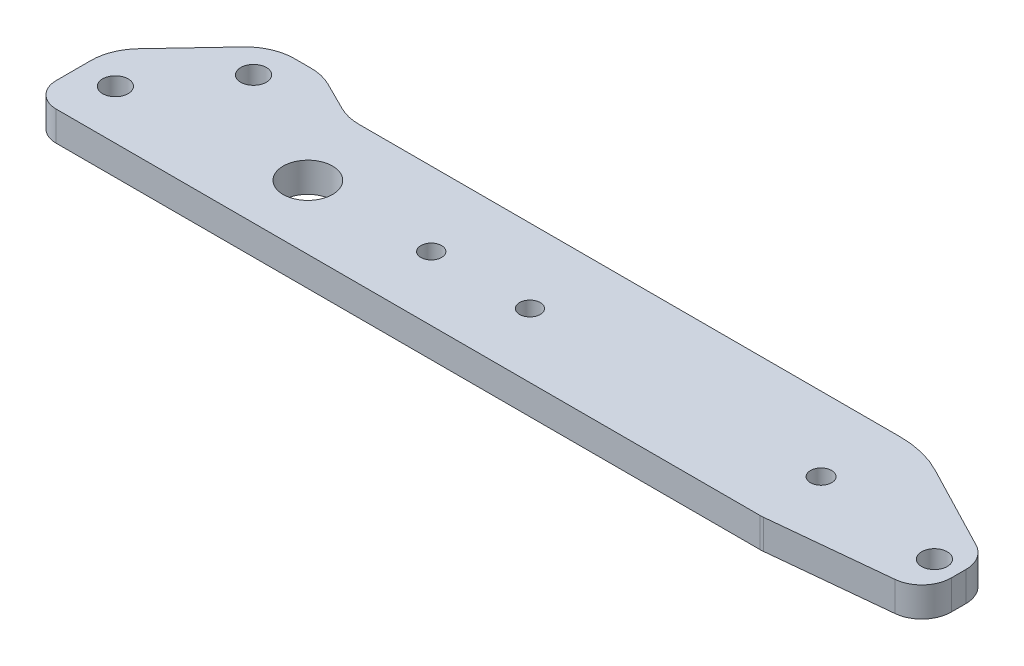
ISO-10303-21;
HEADER;
FILE_DESCRIPTION(('STEP AP214'),'2;1');
FILE_NAME('part.step','',(''),(''),'','','');
FILE_SCHEMA(('AUTOMOTIVE_DESIGN { 1 0 10303 214 1 1 1 1 }'));
ENDSEC;
DATA;
#1=APPLICATION_CONTEXT('core data for automotive mechanical design processes');
#2=APPLICATION_PROTOCOL_DEFINITION('international standard','automotive_design',2000,#1);
#3=PRODUCT_CONTEXT('',#1,'mechanical');
#4=PRODUCT('Part','Part','',(#3));
#5=PRODUCT_RELATED_PRODUCT_CATEGORY('part','',(#4));
#6=PRODUCT_DEFINITION_FORMATION('','',#4);
#7=PRODUCT_DEFINITION_CONTEXT('part definition',#1,'design');
#8=PRODUCT_DEFINITION('design','',#6,#7);
#9=PRODUCT_DEFINITION_SHAPE('','',#8);
#10=(LENGTH_UNIT() NAMED_UNIT(*) SI_UNIT(.MILLI.,.METRE.));
#11=(NAMED_UNIT(*) PLANE_ANGLE_UNIT() SI_UNIT($,.RADIAN.));
#12=(NAMED_UNIT(*) SI_UNIT($,.STERADIAN.) SOLID_ANGLE_UNIT());
#13=UNCERTAINTY_MEASURE_WITH_UNIT(LENGTH_MEASURE(1.E-05),#10,'distance_accuracy_value','');
#14=(GEOMETRIC_REPRESENTATION_CONTEXT(3) GLOBAL_UNCERTAINTY_ASSIGNED_CONTEXT((#13)) GLOBAL_UNIT_ASSIGNED_CONTEXT((#10,
#11,#12)) REPRESENTATION_CONTEXT('',''));
#15=CARTESIAN_POINT('',(0.,0.,0.));
#16=DIRECTION('',(0.,0.,1.));
#17=DIRECTION('',(1.,0.,0.));
#18=AXIS2_PLACEMENT_3D('',#15,#16,#17);
#19=CARTESIAN_POINT('',(0.,6.,0.));
#20=DIRECTION('',(0.,1.,0.));
#21=DIRECTION('',(0.,0.,1.));
#22=AXIS2_PLACEMENT_3D('',#19,#20,#21);
#23=PLANE('',#22);
#24=CARTESIAN_POINT('',(50.,6.,-13.));
#25=DIRECTION('',(0.,1.,0.));
#26=DIRECTION('',(0.,0.,1.));
#27=AXIS2_PLACEMENT_3D('',#24,#25,#26);
#28=CIRCLE('',#27,2.1);
#29=CARTESIAN_POINT('',(50.,6.,-10.9));
#30=VERTEX_POINT('',#29);
#31=EDGE_CURVE('E378',#30,#30,#28,.T.);
#32=ORIENTED_EDGE('',*,*,#31,.F.);
#33=EDGE_LOOP('',(#32));
#34=FACE_BOUND('',#33,.T.);
#35=CARTESIAN_POINT('',(25.,6.,-13.));
#36=DIRECTION('',(0.,1.,0.));
#37=DIRECTION('',(0.,0.,1.));
#38=AXIS2_PLACEMENT_3D('',#35,#36,#37);
#39=CIRCLE('',#38,5.);
#40=CARTESIAN_POINT('',(25.,6.,-8.));
#41=VERTEX_POINT('',#40);
#42=EDGE_CURVE('E366',#41,#41,#39,.T.);
#43=ORIENTED_EDGE('',*,*,#42,.F.);
#44=EDGE_LOOP('',(#43));
#45=FACE_BOUND('',#44,.T.);
#46=CARTESIAN_POINT('',(-11.,6.,-10.));
#47=DIRECTION('',(0.,1.,0.));
#48=DIRECTION('',(0.,0.,1.));
#49=AXIS2_PLACEMENT_3D('',#46,#47,#48);
#50=CIRCLE('',#49,2.6);
#51=CARTESIAN_POINT('',(-11.,6.,-7.4));
#52=VERTEX_POINT('',#51);
#53=EDGE_CURVE('E354',#52,#52,#50,.T.);
#54=ORIENTED_EDGE('',*,*,#53,.F.);
#55=EDGE_LOOP('',(#54));
#56=FACE_BOUND('',#55,.T.);
#57=DIRECTION('',(-0.894427190999916,0.,-0.447213595499958));
#58=VECTOR('',#57,1.);
#59=CARTESIAN_POINT('',(8.,6.,-33.));
#60=LINE('',#59,#58);
#61=CARTESIAN_POINT('',(15.8885438199983,6.,-29.0557280900008));
#62=VERTEX_POINT('',#61);
#63=CARTESIAN_POINT('',(10.1114561800017,6.,-31.9442719099992));
#64=VERTEX_POINT('',#63);
#65=EDGE_CURVE('E286',#62,#64,#60,.T.);
#66=ORIENTED_EDGE('',*,*,#65,.T.);
#67=CARTESIAN_POINT('',(5.63932022500211,6.,-23.));
#68=DIRECTION('',(0.,1.,0.));
#69=DIRECTION('',(0.,0.,1.));
#70=AXIS2_PLACEMENT_3D('',#67,#68,#69);
#71=CIRCLE('',#70,10.);
#72=CARTESIAN_POINT('',(5.63932022500211,6.,-33.));
#73=VERTEX_POINT('',#72);
#74=EDGE_CURVE('E52',#64,#73,#71,.T.);
#75=ORIENTED_EDGE('',*,*,#74,.T.);
#76=DIRECTION('',(-1.,0.,0.));
#77=VECTOR('',#76,1.);
#78=CARTESIAN_POINT('',(-2.,6.,-33.));
#79=LINE('',#78,#77);
#80=CARTESIAN_POINT('',(2.32072650579853,6.,-33.));
#81=VERTEX_POINT('',#80);
#82=EDGE_CURVE('E290',#73,#81,#79,.T.);
#83=ORIENTED_EDGE('',*,*,#82,.T.);
#84=CARTESIAN_POINT('',(2.32072650579853,6.,-23.));
#85=DIRECTION('',(0.,1.,0.));
#86=DIRECTION('',(0.,0.,1.));
#87=AXIS2_PLACEMENT_3D('',#84,#85,#86);
#88=CIRCLE('',#87,10.);
#89=CARTESIAN_POINT('',(-4.96127342112951,6.,-29.8536469900499));
#90=VERTEX_POINT('',#89);
#91=EDGE_CURVE('E242',#81,#90,#88,.T.);
#92=ORIENTED_EDGE('',*,*,#91,.T.);
#93=DIRECTION('',(-0.685364699004991,0.,0.728199992692803));
#94=VECTOR('',#93,1.);
#95=CARTESIAN_POINT('',(-18.,6.,-16.));
#96=LINE('',#95,#94);
#97=CARTESIAN_POINT('',(-15.281999926928,6.,-18.887875077639));
#98=VERTEX_POINT('',#97);
#99=EDGE_CURVE('E292',#90,#98,#96,.T.);
#100=ORIENTED_EDGE('',*,*,#99,.T.);
#101=CARTESIAN_POINT('',(-8.,6.,-12.0342280875891));
#102=DIRECTION('',(0.,1.,0.));
#103=DIRECTION('',(0.,0.,1.));
#104=AXIS2_PLACEMENT_3D('',#101,#102,#103);
#105=CIRCLE('',#104,10.);
#106=CARTESIAN_POINT('',(-18.,6.,-12.0342280875891));
#107=VERTEX_POINT('',#106);
#108=EDGE_CURVE('E240',#98,#107,#105,.T.);
#109=ORIENTED_EDGE('',*,*,#108,.T.);
#110=DIRECTION('',(0.,0.,1.));
#111=VECTOR('',#110,1.);
#112=CARTESIAN_POINT('',(-18.,6.,-16.));
#113=LINE('',#112,#111);
#114=CARTESIAN_POINT('',(-18.,6.,-5.));
#115=VERTEX_POINT('',#114);
#116=EDGE_CURVE('E183',#107,#115,#113,.T.);
#117=ORIENTED_EDGE('',*,*,#116,.T.);
#118=CARTESIAN_POINT('',(-13.,6.,-5.));
#119=DIRECTION('',(0.,1.,0.));
#120=DIRECTION('',(0.,0.,1.));
#121=AXIS2_PLACEMENT_3D('',#118,#119,#120);
#122=CIRCLE('',#121,5.);
#123=CARTESIAN_POINT('',(-13.,6.,0.));
#124=VERTEX_POINT('',#123);
#125=EDGE_CURVE('E199',#115,#124,#122,.T.);
#126=ORIENTED_EDGE('',*,*,#125,.T.);
#127=DIRECTION('',(1.,0.,0.));
#128=VECTOR('',#127,1.);
#129=CARTESIAN_POINT('',(0.,6.,0.));
#130=LINE('',#129,#128);
#131=CARTESIAN_POINT('',(129.666126278875,6.,0.));
#132=VERTEX_POINT('',#131);
#133=EDGE_CURVE('E182',#124,#132,#130,.T.);
#134=ORIENTED_EDGE('',*,*,#133,.T.);
#135=CARTESIAN_POINT('',(129.666126278875,6.,-6.));
#136=DIRECTION('',(0.,1.,0.));
#137=DIRECTION('',(0.,0.,1.));
#138=AXIS2_PLACEMENT_3D('',#135,#136,#137);
#139=CIRCLE('',#138,6.);
#140=CARTESIAN_POINT('',(130.263148593001,6.,-0.0297768587400656));
#141=VERTEX_POINT('',#140);
#142=EDGE_CURVE('E217',#132,#141,#139,.T.);
#143=ORIENTED_EDGE('',*,*,#142,.T.);
#144=DIRECTION('',(0.995037190209989,0.,-0.0995037190209989));
#145=VECTOR('',#144,1.);
#146=CARTESIAN_POINT('',(159.9653800056,6.,-3.));
#147=LINE('',#146,#145);
#148=CARTESIAN_POINT('',(154.562402319726,6.,-2.4597022314126));
#149=VERTEX_POINT('',#148);
#150=EDGE_CURVE('E192',#141,#149,#147,.T.);
#151=ORIENTED_EDGE('',*,*,#150,.T.);
#152=CARTESIAN_POINT('',(153.9653800056,6.,-8.42992537267254));
#153=DIRECTION('',(0.,1.,0.));
#154=DIRECTION('',(0.,0.,1.));
#155=AXIS2_PLACEMENT_3D('',#152,#153,#154);
#156=CIRCLE('',#155,6.);
#157=CARTESIAN_POINT('',(159.9653800056,6.,-8.42992537267254));
#158=VERTEX_POINT('',#157);
#159=EDGE_CURVE('E215',#149,#158,#156,.T.);
#160=ORIENTED_EDGE('',*,*,#159,.T.);
#161=DIRECTION('',(0.,0.,-1.));
#162=VECTOR('',#161,1.);
#163=CARTESIAN_POINT('',(159.9653800056,6.,-3.));
#164=LINE('',#163,#162);
#165=CARTESIAN_POINT('',(159.9653800056,6.,-11.3572786542694));
#166=VERTEX_POINT('',#165);
#167=EDGE_CURVE('E345',#158,#166,#164,.T.);
#168=ORIENTED_EDGE('',*,*,#167,.T.);
#169=CARTESIAN_POINT('',(153.9653800056,6.,-11.3572786542694));
#170=DIRECTION('',(0.,1.,0.));
#171=DIRECTION('',(0.,0.,1.));
#172=AXIS2_PLACEMENT_3D('',#169,#170,#171);
#173=CIRCLE('',#172,6.);
#174=CARTESIAN_POINT('',(156.733496425452,6.,-16.680579461677));
#175=VERTEX_POINT('',#174);
#176=EDGE_CURVE('E213',#166,#175,#173,.T.);
#177=ORIENTED_EDGE('',*,*,#176,.T.);
#178=DIRECTION('',(-0.887216801234595,0.,-0.46135273664199));
#179=VECTOR('',#178,1.);
#180=CARTESIAN_POINT('',(159.9653800056,6.,-15.));
#181=LINE('',#180,#179);
#182=CARTESIAN_POINT('',(139.303195342731,6.,-25.7443360246919));
#183=VERTEX_POINT('',#182);
#184=EDGE_CURVE('E294',#175,#183,#181,.T.);
#185=ORIENTED_EDGE('',*,*,#184,.T.);
#186=CARTESIAN_POINT('',(130.076140609891,6.,-8.));
#187=DIRECTION('',(0.,1.,0.));
#188=DIRECTION('',(0.,0.,1.));
#189=AXIS2_PLACEMENT_3D('',#186,#187,#188);
#190=CIRCLE('',#189,20.);
#191=CARTESIAN_POINT('',(130.076140609891,6.,-28.));
#192=VERTEX_POINT('',#191);
#193=EDGE_CURVE('E254',#183,#192,#190,.T.);
#194=ORIENTED_EDGE('',*,*,#193,.T.);
#195=DIRECTION('',(-1.,0.,0.));
#196=VECTOR('',#195,1.);
#197=CARTESIAN_POINT('',(18.,6.,-28.));
#198=LINE('',#197,#196);
#199=CARTESIAN_POINT('',(20.3606797749979,6.,-28.));
#200=VERTEX_POINT('',#199);
#201=EDGE_CURVE('E287',#192,#200,#198,.T.);
#202=ORIENTED_EDGE('',*,*,#201,.T.);
#203=CARTESIAN_POINT('',(20.3606797749979,6.,-38.));
#204=DIRECTION('',(0.,1.,0.));
#205=DIRECTION('',(0.,0.,1.));
#206=AXIS2_PLACEMENT_3D('',#203,#204,#205);
#207=CIRCLE('',#206,10.);
#208=EDGE_CURVE('E11',#200,#62,#207,.F.);
#209=ORIENTED_EDGE('',*,*,#208,.T.);
#210=EDGE_LOOP('',(#66,#75,#83,#92,#100,#109,#117,#126,#134,#143,#151,#160,#168,#177,#185,#194,
#202,#209));
#211=FACE_BOUND('',#210,.T.);
#212=CARTESIAN_POINT('',(154.9653800056,6.,-10.));
#213=DIRECTION('',(0.,1.,0.));
#214=DIRECTION('',(0.,0.,1.));
#215=AXIS2_PLACEMENT_3D('',#212,#213,#214);
#216=CIRCLE('',#215,2.59999999999999);
#217=CARTESIAN_POINT('',(154.9653800056,6.,-7.40000000000001));
#218=VERTEX_POINT('',#217);
#219=EDGE_CURVE('E305',#218,#218,#216,.T.);
#220=ORIENTED_EDGE('',*,*,#219,.F.);
#221=EDGE_LOOP('',(#220));
#222=FACE_BOUND('',#221,.T.);
#223=CARTESIAN_POINT('',(129.,6.,-13.));
#224=DIRECTION('',(0.,1.,0.));
#225=DIRECTION('',(0.,0.,1.));
#226=AXIS2_PLACEMENT_3D('',#223,#224,#225);
#227=CIRCLE('',#226,2.15000000000002);
#228=CARTESIAN_POINT('',(129.,6.,-10.85));
#229=VERTEX_POINT('',#228);
#230=EDGE_CURVE('E360',#229,#229,#227,.T.);
#231=ORIENTED_EDGE('',*,*,#230,.F.);
#232=EDGE_LOOP('',(#231));
#233=FACE_BOUND('',#232,.T.);
#234=CARTESIAN_POINT('',(0.999999999999992,6.,-26.));
#235=DIRECTION('',(0.,1.,0.));
#236=DIRECTION('',(0.,0.,1.));
#237=AXIS2_PLACEMENT_3D('',#234,#235,#236);
#238=CIRCLE('',#237,2.6);
#239=CARTESIAN_POINT('',(0.999999999999992,6.,-23.4));
#240=VERTEX_POINT('',#239);
#241=EDGE_CURVE('E372',#240,#240,#238,.T.);
#242=ORIENTED_EDGE('',*,*,#241,.F.);
#243=EDGE_LOOP('',(#242));
#244=FACE_BOUND('',#243,.T.);
#245=CARTESIAN_POINT('',(70.,6.,-13.));
#246=DIRECTION('',(0.,1.,0.));
#247=DIRECTION('',(0.,0.,1.));
#248=AXIS2_PLACEMENT_3D('',#245,#246,#247);
#249=CIRCLE('',#248,2.1);
#250=CARTESIAN_POINT('',(70.,6.,-10.9));
#251=VERTEX_POINT('',#250);
#252=EDGE_CURVE('E384',#251,#251,#249,.T.);
#253=ORIENTED_EDGE('',*,*,#252,.F.);
#254=EDGE_LOOP('',(#253));
#255=FACE_BOUND('',#254,.T.);
#256=ADVANCED_FACE('F37',(#34,#45,#56,#211,#222,#233,#244,#255),#23,.T.);
#257=CARTESIAN_POINT('',(0.,0.,0.));
#258=DIRECTION('',(0.,1.,0.));
#259=DIRECTION('',(0.,0.,1.));
#260=AXIS2_PLACEMENT_3D('',#257,#258,#259);
#261=PLANE('',#260);
#262=DIRECTION('',(-1.,0.,0.));
#263=VECTOR('',#262,1.);
#264=CARTESIAN_POINT('',(-2.,0.,-33.));
#265=LINE('',#264,#263);
#266=CARTESIAN_POINT('',(5.63932022500211,0.,-33.));
#267=VERTEX_POINT('',#266);
#268=CARTESIAN_POINT('',(2.32072650579853,0.,-33.));
#269=VERTEX_POINT('',#268);
#270=EDGE_CURVE('E311',#267,#269,#265,.T.);
#271=ORIENTED_EDGE('',*,*,#270,.F.);
#272=CARTESIAN_POINT('',(5.63932022500211,0.,-23.));
#273=DIRECTION('',(0.,1.,0.));
#274=DIRECTION('',(0.,0.,1.));
#275=AXIS2_PLACEMENT_3D('',#272,#273,#274);
#276=CIRCLE('',#275,10.);
#277=CARTESIAN_POINT('',(10.1114561800017,0.,-31.9442719099992));
#278=VERTEX_POINT('',#277);
#279=EDGE_CURVE('E60',#267,#278,#276,.F.);
#280=ORIENTED_EDGE('',*,*,#279,.T.);
#281=DIRECTION('',(-0.894427190999916,0.,-0.447213595499958));
#282=VECTOR('',#281,1.);
#283=CARTESIAN_POINT('',(8.,0.,-33.));
#284=LINE('',#283,#282);
#285=CARTESIAN_POINT('',(15.8885438199983,0.,-29.0557280900008));
#286=VERTEX_POINT('',#285);
#287=EDGE_CURVE('E271',#286,#278,#284,.T.);
#288=ORIENTED_EDGE('',*,*,#287,.F.);
#289=CARTESIAN_POINT('',(20.3606797749979,0.,-38.));
#290=DIRECTION('',(0.,1.,0.));
#291=DIRECTION('',(0.,0.,1.));
#292=AXIS2_PLACEMENT_3D('',#289,#290,#291);
#293=CIRCLE('',#292,10.);
#294=CARTESIAN_POINT('',(20.3606797749979,0.,-28.));
#295=VERTEX_POINT('',#294);
#296=EDGE_CURVE('E45',#286,#295,#293,.T.);
#297=ORIENTED_EDGE('',*,*,#296,.T.);
#298=DIRECTION('',(-1.,0.,0.));
#299=VECTOR('',#298,1.);
#300=CARTESIAN_POINT('',(18.,0.,-28.));
#301=LINE('',#300,#299);
#302=CARTESIAN_POINT('',(130.076140609891,0.,-28.));
#303=VERTEX_POINT('',#302);
#304=EDGE_CURVE('E269',#303,#295,#301,.T.);
#305=ORIENTED_EDGE('',*,*,#304,.F.);
#306=CARTESIAN_POINT('',(130.076140609891,0.,-8.));
#307=DIRECTION('',(0.,1.,0.));
#308=DIRECTION('',(0.,0.,1.));
#309=AXIS2_PLACEMENT_3D('',#306,#307,#308);
#310=CIRCLE('',#309,20.);
#311=CARTESIAN_POINT('',(139.303195342731,0.,-25.7443360246919));
#312=VERTEX_POINT('',#311);
#313=EDGE_CURVE('E250',#303,#312,#310,.F.);
#314=ORIENTED_EDGE('',*,*,#313,.T.);
#315=DIRECTION('',(-0.887216801234595,0.,-0.46135273664199));
#316=VECTOR('',#315,1.);
#317=CARTESIAN_POINT('',(159.9653800056,0.,-15.));
#318=LINE('',#317,#316);
#319=CARTESIAN_POINT('',(156.733496425452,0.,-16.680579461677));
#320=VERTEX_POINT('',#319);
#321=EDGE_CURVE('E280',#320,#312,#318,.T.);
#322=ORIENTED_EDGE('',*,*,#321,.F.);
#323=CARTESIAN_POINT('',(153.9653800056,0.,-11.3572786542694));
#324=DIRECTION('',(0.,1.,0.));
#325=DIRECTION('',(0.,0.,1.));
#326=AXIS2_PLACEMENT_3D('',#323,#324,#325);
#327=CIRCLE('',#326,6.);
#328=CARTESIAN_POINT('',(159.9653800056,0.,-11.3572786542694));
#329=VERTEX_POINT('',#328);
#330=EDGE_CURVE('E206',#320,#329,#327,.F.);
#331=ORIENTED_EDGE('',*,*,#330,.T.);
#332=DIRECTION('',(0.,0.,-1.));
#333=VECTOR('',#332,1.);
#334=CARTESIAN_POINT('',(159.9653800056,0.,-3.));
#335=LINE('',#334,#333);
#336=CARTESIAN_POINT('',(159.9653800056,0.,-8.42992537267254));
#337=VERTEX_POINT('',#336);
#338=EDGE_CURVE('E304',#337,#329,#335,.T.);
#339=ORIENTED_EDGE('',*,*,#338,.F.);
#340=CARTESIAN_POINT('',(153.9653800056,0.,-8.42992537267254));
#341=DIRECTION('',(0.,1.,0.));
#342=DIRECTION('',(0.,0.,1.));
#343=AXIS2_PLACEMENT_3D('',#340,#341,#342);
#344=CIRCLE('',#343,6.);
#345=CARTESIAN_POINT('',(154.562402319726,0.,-2.4597022314126));
#346=VERTEX_POINT('',#345);
#347=EDGE_CURVE('E208',#337,#346,#344,.F.);
#348=ORIENTED_EDGE('',*,*,#347,.T.);
#349=DIRECTION('',(0.995037190209989,0.,-0.0995037190209989));
#350=VECTOR('',#349,1.);
#351=CARTESIAN_POINT('',(159.9653800056,0.,-3.));
#352=LINE('',#351,#350);
#353=CARTESIAN_POINT('',(130.263148593001,0.,-0.0297768587400656));
#354=VERTEX_POINT('',#353);
#355=EDGE_CURVE('E301',#354,#346,#352,.T.);
#356=ORIENTED_EDGE('',*,*,#355,.F.);
#357=CARTESIAN_POINT('',(129.666126278875,0.,-6.));
#358=DIRECTION('',(0.,1.,0.));
#359=DIRECTION('',(0.,0.,1.));
#360=AXIS2_PLACEMENT_3D('',#357,#358,#359);
#361=CIRCLE('',#360,6.);
#362=CARTESIAN_POINT('',(129.666126278875,0.,0.));
#363=VERTEX_POINT('',#362);
#364=EDGE_CURVE('E189',#354,#363,#361,.F.);
#365=ORIENTED_EDGE('',*,*,#364,.T.);
#366=DIRECTION('',(1.,0.,0.));
#367=VECTOR('',#366,1.);
#368=CARTESIAN_POINT('',(-18.,0.,0.));
#369=LINE('',#368,#367);
#370=CARTESIAN_POINT('',(-13.,0.,0.));
#371=VERTEX_POINT('',#370);
#372=EDGE_CURVE('E179',#371,#363,#369,.T.);
#373=ORIENTED_EDGE('',*,*,#372,.F.);
#374=CARTESIAN_POINT('',(-13.,0.,-5.));
#375=DIRECTION('',(0.,1.,0.));
#376=DIRECTION('',(0.,0.,1.));
#377=AXIS2_PLACEMENT_3D('',#374,#375,#376);
#378=CIRCLE('',#377,5.);
#379=CARTESIAN_POINT('',(-18.,0.,-5.));
#380=VERTEX_POINT('',#379);
#381=EDGE_CURVE('E164',#371,#380,#378,.F.);
#382=ORIENTED_EDGE('',*,*,#381,.T.);
#383=DIRECTION('',(0.,0.,1.));
#384=VECTOR('',#383,1.);
#385=CARTESIAN_POINT('',(-18.,0.,-16.));
#386=LINE('',#385,#384);
#387=CARTESIAN_POINT('',(-18.,0.,-12.0342280875891));
#388=VERTEX_POINT('',#387);
#389=EDGE_CURVE('E190',#388,#380,#386,.T.);
#390=ORIENTED_EDGE('',*,*,#389,.F.);
#391=CARTESIAN_POINT('',(-8.,0.,-12.0342280875891));
#392=DIRECTION('',(0.,1.,0.));
#393=DIRECTION('',(0.,0.,1.));
#394=AXIS2_PLACEMENT_3D('',#391,#392,#393);
#395=CIRCLE('',#394,10.);
#396=CARTESIAN_POINT('',(-15.281999926928,0.,-18.887875077639));
#397=VERTEX_POINT('',#396);
#398=EDGE_CURVE('E232',#388,#397,#395,.F.);
#399=ORIENTED_EDGE('',*,*,#398,.T.);
#400=DIRECTION('',(-0.685364699004991,0.,0.728199992692803));
#401=VECTOR('',#400,1.);
#402=CARTESIAN_POINT('',(-18.,0.,-16.));
#403=LINE('',#402,#401);
#404=CARTESIAN_POINT('',(-4.96127342112951,0.,-29.8536469900499));
#405=VERTEX_POINT('',#404);
#406=EDGE_CURVE('E194',#405,#397,#403,.T.);
#407=ORIENTED_EDGE('',*,*,#406,.F.);
#408=CARTESIAN_POINT('',(2.32072650579853,0.,-23.));
#409=DIRECTION('',(0.,1.,0.));
#410=DIRECTION('',(0.,0.,1.));
#411=AXIS2_PLACEMENT_3D('',#408,#409,#410);
#412=CIRCLE('',#411,10.);
#413=EDGE_CURVE('E234',#405,#269,#412,.F.);
#414=ORIENTED_EDGE('',*,*,#413,.T.);
#415=EDGE_LOOP('',(#271,#280,#288,#297,#305,#314,#322,#331,#339,#348,#356,#365,#373,#382,#390,
#399,#407,#414));
#416=FACE_BOUND('',#415,.T.);
#417=CARTESIAN_POINT('',(154.9653800056,0.,-10.));
#418=DIRECTION('',(0.,1.,0.));
#419=DIRECTION('',(0.,0.,1.));
#420=AXIS2_PLACEMENT_3D('',#417,#418,#419);
#421=CIRCLE('',#420,2.59999999999999);
#422=CARTESIAN_POINT('',(154.9653800056,0.,-7.40000000000001));
#423=VERTEX_POINT('',#422);
#424=EDGE_CURVE('E351',#423,#423,#421,.T.);
#425=ORIENTED_EDGE('',*,*,#424,.T.);
#426=EDGE_LOOP('',(#425));
#427=FACE_BOUND('',#426,.T.);
#428=CARTESIAN_POINT('',(-11.,0.,-10.));
#429=DIRECTION('',(0.,1.,0.));
#430=DIRECTION('',(0.,0.,1.));
#431=AXIS2_PLACEMENT_3D('',#428,#429,#430);
#432=CIRCLE('',#431,2.6);
#433=CARTESIAN_POINT('',(-11.,0.,-7.4));
#434=VERTEX_POINT('',#433);
#435=EDGE_CURVE('E357',#434,#434,#432,.T.);
#436=ORIENTED_EDGE('',*,*,#435,.T.);
#437=EDGE_LOOP('',(#436));
#438=FACE_BOUND('',#437,.T.);
#439=CARTESIAN_POINT('',(129.,0.,-13.));
#440=DIRECTION('',(0.,1.,0.));
#441=DIRECTION('',(0.,0.,1.));
#442=AXIS2_PLACEMENT_3D('',#439,#440,#441);
#443=CIRCLE('',#442,2.15000000000002);
#444=CARTESIAN_POINT('',(129.,0.,-10.85));
#445=VERTEX_POINT('',#444);
#446=EDGE_CURVE('E363',#445,#445,#443,.T.);
#447=ORIENTED_EDGE('',*,*,#446,.T.);
#448=EDGE_LOOP('',(#447));
#449=FACE_BOUND('',#448,.T.);
#450=CARTESIAN_POINT('',(25.,0.,-13.));
#451=DIRECTION('',(0.,1.,0.));
#452=DIRECTION('',(0.,0.,1.));
#453=AXIS2_PLACEMENT_3D('',#450,#451,#452);
#454=CIRCLE('',#453,5.);
#455=CARTESIAN_POINT('',(25.,0.,-8.));
#456=VERTEX_POINT('',#455);
#457=EDGE_CURVE('E369',#456,#456,#454,.T.);
#458=ORIENTED_EDGE('',*,*,#457,.T.);
#459=EDGE_LOOP('',(#458));
#460=FACE_BOUND('',#459,.T.);
#461=CARTESIAN_POINT('',(0.999999999999992,0.,-26.));
#462=DIRECTION('',(0.,1.,0.));
#463=DIRECTION('',(0.,0.,1.));
#464=AXIS2_PLACEMENT_3D('',#461,#462,#463);
#465=CIRCLE('',#464,2.6);
#466=CARTESIAN_POINT('',(0.999999999999992,0.,-23.4));
#467=VERTEX_POINT('',#466);
#468=EDGE_CURVE('E375',#467,#467,#465,.T.);
#469=ORIENTED_EDGE('',*,*,#468,.T.);
#470=EDGE_LOOP('',(#469));
#471=FACE_BOUND('',#470,.T.);
#472=CARTESIAN_POINT('',(50.,0.,-13.));
#473=DIRECTION('',(0.,1.,0.));
#474=DIRECTION('',(0.,0.,1.));
#475=AXIS2_PLACEMENT_3D('',#472,#473,#474);
#476=CIRCLE('',#475,2.1);
#477=CARTESIAN_POINT('',(50.,0.,-10.9));
#478=VERTEX_POINT('',#477);
#479=EDGE_CURVE('E381',#478,#478,#476,.T.);
#480=ORIENTED_EDGE('',*,*,#479,.T.);
#481=EDGE_LOOP('',(#480));
#482=FACE_BOUND('',#481,.T.);
#483=CARTESIAN_POINT('',(70.,0.,-13.));
#484=DIRECTION('',(0.,1.,0.));
#485=DIRECTION('',(0.,0.,1.));
#486=AXIS2_PLACEMENT_3D('',#483,#484,#485);
#487=CIRCLE('',#486,2.1);
#488=CARTESIAN_POINT('',(70.,0.,-10.9));
#489=VERTEX_POINT('',#488);
#490=EDGE_CURVE('E387',#489,#489,#487,.T.);
#491=ORIENTED_EDGE('',*,*,#490,.T.);
#492=EDGE_LOOP('',(#491));
#493=FACE_BOUND('',#492,.T.);
#494=ADVANCED_FACE('F186',(#416,#427,#438,#449,#460,#471,#482,#493),#261,.F.);
#495=CARTESIAN_POINT('',(159.9653800056,6.,-3.));
#496=DIRECTION('',(-0.0995037190209989,0.,-0.995037190209989));
#497=DIRECTION('',(-0.995037190209989,0.,0.0995037190209989));
#498=AXIS2_PLACEMENT_3D('',#495,#496,#497);
#499=PLANE('',#498);
#500=ORIENTED_EDGE('',*,*,#150,.F.);
#501=DIRECTION('',(0.,-1.,0.));
#502=VECTOR('',#501,1.);
#503=CARTESIAN_POINT('',(130.263148593001,6.,-0.0297768587400652));
#504=LINE('',#503,#502);
#505=EDGE_CURVE('E203',#141,#354,#504,.T.);
#506=ORIENTED_EDGE('',*,*,#505,.T.);
#507=ORIENTED_EDGE('',*,*,#355,.T.);
#508=DIRECTION('',(0.,-1.,0.));
#509=VECTOR('',#508,1.);
#510=CARTESIAN_POINT('',(154.562402319726,6.,-2.4597022314126));
#511=LINE('',#510,#509);
#512=EDGE_CURVE('E201',#346,#149,#511,.F.);
#513=ORIENTED_EDGE('',*,*,#512,.T.);
#514=EDGE_LOOP('',(#500,#506,#507,#513));
#515=FACE_BOUND('',#514,.T.);
#516=ADVANCED_FACE('F333',(#515),#499,.F.);
#517=CARTESIAN_POINT('',(159.9653800056,6.,-3.));
#518=DIRECTION('',(-1.,0.,0.));
#519=DIRECTION('',(0.,0.,1.));
#520=AXIS2_PLACEMENT_3D('',#517,#518,#519);
#521=PLANE('',#520);
#522=ORIENTED_EDGE('',*,*,#167,.F.);
#523=DIRECTION('',(0.,-1.,0.));
#524=VECTOR('',#523,1.);
#525=CARTESIAN_POINT('',(159.9653800056,6.,-8.42992537267254));
#526=LINE('',#525,#524);
#527=EDGE_CURVE('E221',#158,#337,#526,.T.);
#528=ORIENTED_EDGE('',*,*,#527,.T.);
#529=ORIENTED_EDGE('',*,*,#338,.T.);
#530=DIRECTION('',(0.,-1.,0.));
#531=VECTOR('',#530,1.);
#532=CARTESIAN_POINT('',(159.9653800056,6.,-11.3572786542694));
#533=LINE('',#532,#531);
#534=EDGE_CURVE('E219',#329,#166,#533,.F.);
#535=ORIENTED_EDGE('',*,*,#534,.T.);
#536=EDGE_LOOP('',(#522,#528,#529,#535));
#537=FACE_BOUND('',#536,.T.);
#538=ADVANCED_FACE('F342',(#537),#521,.F.);
#539=CARTESIAN_POINT('',(159.9653800056,6.,-15.));
#540=DIRECTION('',(-0.46135273664199,0.,0.887216801234595));
#541=DIRECTION('',(0.887216801234595,0.,0.46135273664199));
#542=AXIS2_PLACEMENT_3D('',#539,#540,#541);
#543=PLANE('',#542);
#544=ORIENTED_EDGE('',*,*,#321,.T.);
#545=DIRECTION('',(0.,-1.,0.));
#546=VECTOR('',#545,1.);
#547=CARTESIAN_POINT('',(139.303195342731,6.,-25.7443360246919));
#548=LINE('',#547,#546);
#549=EDGE_CURVE('E252',#312,#183,#548,.F.);
#550=ORIENTED_EDGE('',*,*,#549,.T.);
#551=ORIENTED_EDGE('',*,*,#184,.F.);
#552=DIRECTION('',(0.,-1.,0.));
#553=VECTOR('',#552,1.);
#554=CARTESIAN_POINT('',(156.733496425452,6.,-16.680579461677));
#555=LINE('',#554,#553);
#556=EDGE_CURVE('E224',#175,#320,#555,.T.);
#557=ORIENTED_EDGE('',*,*,#556,.T.);
#558=EDGE_LOOP('',(#544,#550,#551,#557));
#559=FACE_BOUND('',#558,.T.);
#560=ADVANCED_FACE('F423',(#559),#543,.F.);
#561=CARTESIAN_POINT('',(18.,6.,-28.));
#562=DIRECTION('',(0.,0.,1.));
#563=DIRECTION('',(1.,0.,0.));
#564=AXIS2_PLACEMENT_3D('',#561,#562,#563);
#565=PLANE('',#564);
#566=ORIENTED_EDGE('',*,*,#304,.T.);
#567=DIRECTION('',(0.,-1.,0.));
#568=VECTOR('',#567,1.);
#569=CARTESIAN_POINT('',(20.3606797749979,6.,-28.));
#570=LINE('',#569,#568);
#571=EDGE_CURVE('E261',#295,#200,#570,.F.);
#572=ORIENTED_EDGE('',*,*,#571,.T.);
#573=ORIENTED_EDGE('',*,*,#201,.F.);
#574=DIRECTION('',(0.,-1.,0.));
#575=VECTOR('',#574,1.);
#576=CARTESIAN_POINT('',(130.076140609891,6.,-28.));
#577=LINE('',#576,#575);
#578=EDGE_CURVE('E247',#192,#303,#577,.T.);
#579=ORIENTED_EDGE('',*,*,#578,.T.);
#580=EDGE_LOOP('',(#566,#572,#573,#579));
#581=FACE_BOUND('',#580,.T.);
#582=ADVANCED_FACE('F276',(#581),#565,.F.);
#583=CARTESIAN_POINT('',(8.,6.,-33.));
#584=DIRECTION('',(-0.447213595499958,0.,0.894427190999916));
#585=DIRECTION('',(0.894427190999916,0.,0.447213595499958));
#586=AXIS2_PLACEMENT_3D('',#583,#584,#585);
#587=PLANE('',#586);
#588=ORIENTED_EDGE('',*,*,#65,.F.);
#589=DIRECTION('',(0.,-1.,0.));
#590=VECTOR('',#589,1.);
#591=CARTESIAN_POINT('',(15.8885438199983,0.,-29.0557280900008));
#592=LINE('',#591,#590);
#593=EDGE_CURVE('E258',#62,#286,#592,.T.);
#594=ORIENTED_EDGE('',*,*,#593,.T.);
#595=ORIENTED_EDGE('',*,*,#287,.T.);
#596=DIRECTION('',(0.,-1.,0.));
#597=VECTOR('',#596,1.);
#598=CARTESIAN_POINT('',(10.1114561800017,6.,-31.9442719099992));
#599=LINE('',#598,#597);
#600=EDGE_CURVE('E256',#278,#64,#599,.F.);
#601=ORIENTED_EDGE('',*,*,#600,.T.);
#602=EDGE_LOOP('',(#588,#594,#595,#601));
#603=FACE_BOUND('',#602,.T.);
#604=ADVANCED_FACE('F289',(#603),#587,.F.);
#605=CARTESIAN_POINT('',(-2.,6.,-33.));
#606=DIRECTION('',(0.,0.,1.));
#607=DIRECTION('',(1.,0.,0.));
#608=AXIS2_PLACEMENT_3D('',#605,#606,#607);
#609=PLANE('',#608);
#610=ORIENTED_EDGE('',*,*,#82,.F.);
#611=DIRECTION('',(0.,-1.,0.));
#612=VECTOR('',#611,1.);
#613=CARTESIAN_POINT('',(5.63932022500211,6.,-33.));
#614=LINE('',#613,#612);
#615=EDGE_CURVE('E263',#73,#267,#614,.T.);
#616=ORIENTED_EDGE('',*,*,#615,.T.);
#617=ORIENTED_EDGE('',*,*,#270,.T.);
#618=DIRECTION('',(0.,-1.,0.));
#619=VECTOR('',#618,1.);
#620=CARTESIAN_POINT('',(2.32072650579853,6.,-33.));
#621=LINE('',#620,#619);
#622=EDGE_CURVE('E237',#269,#81,#621,.F.);
#623=ORIENTED_EDGE('',*,*,#622,.T.);
#624=EDGE_LOOP('',(#610,#616,#617,#623));
#625=FACE_BOUND('',#624,.T.);
#626=ADVANCED_FACE('F415',(#625),#609,.F.);
#627=CARTESIAN_POINT('',(-18.,6.,-16.));
#628=DIRECTION('',(0.728199992692803,0.,0.685364699004991));
#629=DIRECTION('',(0.685364699004991,0.,-0.728199992692803));
#630=AXIS2_PLACEMENT_3D('',#627,#628,#629);
#631=PLANE('',#630);
#632=ORIENTED_EDGE('',*,*,#99,.F.);
#633=DIRECTION('',(0.,-1.,0.));
#634=VECTOR('',#633,1.);
#635=CARTESIAN_POINT('',(-4.9612734211295,6.,-29.8536469900499));
#636=LINE('',#635,#634);
#637=EDGE_CURVE('E229',#90,#405,#636,.T.);
#638=ORIENTED_EDGE('',*,*,#637,.T.);
#639=ORIENTED_EDGE('',*,*,#406,.T.);
#640=DIRECTION('',(0.,-1.,0.));
#641=VECTOR('',#640,1.);
#642=CARTESIAN_POINT('',(-15.281999926928,6.,-18.887875077639));
#643=LINE('',#642,#641);
#644=EDGE_CURVE('E227',#397,#98,#643,.F.);
#645=ORIENTED_EDGE('',*,*,#644,.T.);
#646=EDGE_LOOP('',(#632,#638,#639,#645));
#647=FACE_BOUND('',#646,.T.);
#648=ADVANCED_FACE('F317',(#647),#631,.F.);
#649=CARTESIAN_POINT('',(-18.,6.,-16.));
#650=DIRECTION('',(1.,0.,0.));
#651=DIRECTION('',(0.,0.,-1.));
#652=AXIS2_PLACEMENT_3D('',#649,#650,#651);
#653=PLANE('',#652);
#654=ORIENTED_EDGE('',*,*,#116,.F.);
#655=DIRECTION('',(0.,-1.,0.));
#656=VECTOR('',#655,1.);
#657=CARTESIAN_POINT('',(-18.,6.,-12.0342280875891));
#658=LINE('',#657,#656);
#659=EDGE_CURVE('E244',#107,#388,#658,.T.);
#660=ORIENTED_EDGE('',*,*,#659,.T.);
#661=ORIENTED_EDGE('',*,*,#389,.T.);
#662=DIRECTION('',(0.,-1.,0.));
#663=VECTOR('',#662,1.);
#664=CARTESIAN_POINT('',(-18.,6.,-5.));
#665=LINE('',#664,#663);
#666=EDGE_CURVE('E170',#380,#115,#665,.F.);
#667=ORIENTED_EDGE('',*,*,#666,.T.);
#668=EDGE_LOOP('',(#654,#660,#661,#667));
#669=FACE_BOUND('',#668,.T.);
#670=ADVANCED_FACE('F325',(#669),#653,.F.);
#671=CARTESIAN_POINT('',(-18.,6.,0.));
#672=DIRECTION('',(0.,0.,-1.));
#673=DIRECTION('',(-1.,0.,0.));
#674=AXIS2_PLACEMENT_3D('',#671,#672,#673);
#675=PLANE('',#674);
#676=ORIENTED_EDGE('',*,*,#372,.T.);
#677=DIRECTION('',(0.,-1.,0.));
#678=VECTOR('',#677,1.);
#679=CARTESIAN_POINT('',(129.666126278875,6.,0.));
#680=LINE('',#679,#678);
#681=EDGE_CURVE('E211',#363,#132,#680,.F.);
#682=ORIENTED_EDGE('',*,*,#681,.T.);
#683=ORIENTED_EDGE('',*,*,#133,.F.);
#684=DIRECTION('',(0.,-1.,0.));
#685=VECTOR('',#684,1.);
#686=CARTESIAN_POINT('',(-13.,6.,0.));
#687=LINE('',#686,#685);
#688=EDGE_CURVE('E168',#124,#371,#687,.T.);
#689=ORIENTED_EDGE('',*,*,#688,.T.);
#690=EDGE_LOOP('',(#676,#682,#683,#689));
#691=FACE_BOUND('',#690,.T.);
#692=ADVANCED_FACE('F178',(#691),#675,.F.);
#693=CARTESIAN_POINT('',(154.9653800056,6.,-10.));
#694=DIRECTION('',(0.,-1.,0.));
#695=DIRECTION('',(0.,0.,-1.));
#696=AXIS2_PLACEMENT_3D('',#693,#694,#695);
#697=CYLINDRICAL_SURFACE('',#696,2.59999999999999);
#698=ORIENTED_EDGE('',*,*,#219,.T.);
#699=EDGE_LOOP('',(#698));
#700=FACE_BOUND('',#699,.T.);
#701=ORIENTED_EDGE('',*,*,#424,.F.);
#702=EDGE_LOOP('',(#701));
#703=FACE_BOUND('',#702,.T.);
#704=ADVANCED_FACE('F406',(#700,#703),#697,.F.);
#705=CARTESIAN_POINT('',(-11.,6.,-10.));
#706=DIRECTION('',(0.,-1.,0.));
#707=DIRECTION('',(0.,0.,-1.));
#708=AXIS2_PLACEMENT_3D('',#705,#706,#707);
#709=CYLINDRICAL_SURFACE('',#708,2.6);
#710=ORIENTED_EDGE('',*,*,#53,.T.);
#711=EDGE_LOOP('',(#710));
#712=FACE_BOUND('',#711,.T.);
#713=ORIENTED_EDGE('',*,*,#435,.F.);
#714=EDGE_LOOP('',(#713));
#715=FACE_BOUND('',#714,.T.);
#716=ADVANCED_FACE('F642',(#712,#715),#709,.F.);
#717=CARTESIAN_POINT('',(129.,6.,-13.));
#718=DIRECTION('',(0.,-1.,0.));
#719=DIRECTION('',(0.,0.,-1.));
#720=AXIS2_PLACEMENT_3D('',#717,#718,#719);
#721=CYLINDRICAL_SURFACE('',#720,2.15000000000002);
#722=ORIENTED_EDGE('',*,*,#230,.T.);
#723=EDGE_LOOP('',(#722));
#724=FACE_BOUND('',#723,.T.);
#725=ORIENTED_EDGE('',*,*,#446,.F.);
#726=EDGE_LOOP('',(#725));
#727=FACE_BOUND('',#726,.T.);
#728=ADVANCED_FACE('F631',(#724,#727),#721,.F.);
#729=CARTESIAN_POINT('',(25.,6.,-13.));
#730=DIRECTION('',(0.,-1.,0.));
#731=DIRECTION('',(0.,0.,-1.));
#732=AXIS2_PLACEMENT_3D('',#729,#730,#731);
#733=CYLINDRICAL_SURFACE('',#732,5.);
#734=ORIENTED_EDGE('',*,*,#42,.T.);
#735=EDGE_LOOP('',(#734));
#736=FACE_BOUND('',#735,.T.);
#737=ORIENTED_EDGE('',*,*,#457,.F.);
#738=EDGE_LOOP('',(#737));
#739=FACE_BOUND('',#738,.T.);
#740=ADVANCED_FACE('F620',(#736,#739),#733,.F.);
#741=CARTESIAN_POINT('',(0.999999999999992,6.,-26.));
#742=DIRECTION('',(0.,-1.,0.));
#743=DIRECTION('',(0.,0.,-1.));
#744=AXIS2_PLACEMENT_3D('',#741,#742,#743);
#745=CYLINDRICAL_SURFACE('',#744,2.6);
#746=ORIENTED_EDGE('',*,*,#241,.T.);
#747=EDGE_LOOP('',(#746));
#748=FACE_BOUND('',#747,.T.);
#749=ORIENTED_EDGE('',*,*,#468,.F.);
#750=EDGE_LOOP('',(#749));
#751=FACE_BOUND('',#750,.T.);
#752=ADVANCED_FACE('F609',(#748,#751),#745,.F.);
#753=CARTESIAN_POINT('',(50.,6.,-13.));
#754=DIRECTION('',(0.,-1.,0.));
#755=DIRECTION('',(0.,0.,-1.));
#756=AXIS2_PLACEMENT_3D('',#753,#754,#755);
#757=CYLINDRICAL_SURFACE('',#756,2.1);
#758=ORIENTED_EDGE('',*,*,#31,.T.);
#759=EDGE_LOOP('',(#758));
#760=FACE_BOUND('',#759,.T.);
#761=ORIENTED_EDGE('',*,*,#479,.F.);
#762=EDGE_LOOP('',(#761));
#763=FACE_BOUND('',#762,.T.);
#764=ADVANCED_FACE('F599',(#760,#763),#757,.F.);
#765=CARTESIAN_POINT('',(70.,6.,-13.));
#766=DIRECTION('',(0.,-1.,0.));
#767=DIRECTION('',(0.,0.,-1.));
#768=AXIS2_PLACEMENT_3D('',#765,#766,#767);
#769=CYLINDRICAL_SURFACE('',#768,2.1);
#770=ORIENTED_EDGE('',*,*,#252,.T.);
#771=EDGE_LOOP('',(#770));
#772=FACE_BOUND('',#771,.T.);
#773=ORIENTED_EDGE('',*,*,#490,.F.);
#774=EDGE_LOOP('',(#773));
#775=FACE_BOUND('',#774,.T.);
#776=ADVANCED_FACE('F393',(#772,#775),#769,.F.);
#777=CARTESIAN_POINT('',(-13.,6.,-5.));
#778=DIRECTION('',(0.,-1.,0.));
#779=DIRECTION('',(0.,0.,-1.));
#780=AXIS2_PLACEMENT_3D('',#777,#778,#779);
#781=CYLINDRICAL_SURFACE('',#780,5.);
#782=ORIENTED_EDGE('',*,*,#125,.F.);
#783=ORIENTED_EDGE('',*,*,#666,.F.);
#784=ORIENTED_EDGE('',*,*,#381,.F.);
#785=ORIENTED_EDGE('',*,*,#688,.F.);
#786=EDGE_LOOP('',(#782,#783,#784,#785));
#787=FACE_BOUND('',#786,.T.);
#788=ADVANCED_FACE('F167',(#787),#781,.T.);
#789=CARTESIAN_POINT('',(129.666126278875,6.,-6.));
#790=DIRECTION('',(0.,-1.,0.));
#791=DIRECTION('',(0.,0.,-1.));
#792=AXIS2_PLACEMENT_3D('',#789,#790,#791);
#793=CYLINDRICAL_SURFACE('',#792,6.);
#794=ORIENTED_EDGE('',*,*,#142,.F.);
#795=ORIENTED_EDGE('',*,*,#681,.F.);
#796=ORIENTED_EDGE('',*,*,#364,.F.);
#797=ORIENTED_EDGE('',*,*,#505,.F.);
#798=EDGE_LOOP('',(#794,#795,#796,#797));
#799=FACE_BOUND('',#798,.T.);
#800=ADVANCED_FACE('F331',(#799),#793,.T.);
#801=CARTESIAN_POINT('',(153.9653800056,6.,-8.42992537267254));
#802=DIRECTION('',(0.,-1.,0.));
#803=DIRECTION('',(0.,0.,-1.));
#804=AXIS2_PLACEMENT_3D('',#801,#802,#803);
#805=CYLINDRICAL_SURFACE('',#804,6.);
#806=ORIENTED_EDGE('',*,*,#159,.F.);
#807=ORIENTED_EDGE('',*,*,#512,.F.);
#808=ORIENTED_EDGE('',*,*,#347,.F.);
#809=ORIENTED_EDGE('',*,*,#527,.F.);
#810=EDGE_LOOP('',(#806,#807,#808,#809));
#811=FACE_BOUND('',#810,.T.);
#812=ADVANCED_FACE('F339',(#811),#805,.T.);
#813=CARTESIAN_POINT('',(153.9653800056,6.,-11.3572786542694));
#814=DIRECTION('',(0.,-1.,0.));
#815=DIRECTION('',(0.,0.,-1.));
#816=AXIS2_PLACEMENT_3D('',#813,#814,#815);
#817=CYLINDRICAL_SURFACE('',#816,6.);
#818=ORIENTED_EDGE('',*,*,#176,.F.);
#819=ORIENTED_EDGE('',*,*,#534,.F.);
#820=ORIENTED_EDGE('',*,*,#330,.F.);
#821=ORIENTED_EDGE('',*,*,#556,.F.);
#822=EDGE_LOOP('',(#818,#819,#820,#821));
#823=FACE_BOUND('',#822,.T.);
#824=ADVANCED_FACE('F437',(#823),#817,.T.);
#825=CARTESIAN_POINT('',(2.32072650579853,6.,-23.));
#826=DIRECTION('',(0.,-1.,0.));
#827=DIRECTION('',(0.,0.,-1.));
#828=AXIS2_PLACEMENT_3D('',#825,#826,#827);
#829=CYLINDRICAL_SURFACE('',#828,10.);
#830=ORIENTED_EDGE('',*,*,#91,.F.);
#831=ORIENTED_EDGE('',*,*,#622,.F.);
#832=ORIENTED_EDGE('',*,*,#413,.F.);
#833=ORIENTED_EDGE('',*,*,#637,.F.);
#834=EDGE_LOOP('',(#830,#831,#832,#833));
#835=FACE_BOUND('',#834,.T.);
#836=ADVANCED_FACE('F440',(#835),#829,.T.);
#837=CARTESIAN_POINT('',(-8.,6.,-12.0342280875891));
#838=DIRECTION('',(0.,-1.,0.));
#839=DIRECTION('',(0.,0.,-1.));
#840=AXIS2_PLACEMENT_3D('',#837,#838,#839);
#841=CYLINDRICAL_SURFACE('',#840,10.);
#842=ORIENTED_EDGE('',*,*,#108,.F.);
#843=ORIENTED_EDGE('',*,*,#644,.F.);
#844=ORIENTED_EDGE('',*,*,#398,.F.);
#845=ORIENTED_EDGE('',*,*,#659,.F.);
#846=EDGE_LOOP('',(#842,#843,#844,#845));
#847=FACE_BOUND('',#846,.T.);
#848=ADVANCED_FACE('F321',(#847),#841,.T.);
#849=CARTESIAN_POINT('',(130.076140609891,6.,-8.));
#850=DIRECTION('',(0.,-1.,0.));
#851=DIRECTION('',(0.,0.,-1.));
#852=AXIS2_PLACEMENT_3D('',#849,#850,#851);
#853=CYLINDRICAL_SURFACE('',#852,20.);
#854=ORIENTED_EDGE('',*,*,#193,.F.);
#855=ORIENTED_EDGE('',*,*,#549,.F.);
#856=ORIENTED_EDGE('',*,*,#313,.F.);
#857=ORIENTED_EDGE('',*,*,#578,.F.);
#858=EDGE_LOOP('',(#854,#855,#856,#857));
#859=FACE_BOUND('',#858,.T.);
#860=ADVANCED_FACE('F447',(#859),#853,.T.);
#861=CARTESIAN_POINT('',(20.3606797749979,6.,-38.));
#862=DIRECTION('',(0.,1.,0.));
#863=DIRECTION('',(0.,0.,1.));
#864=AXIS2_PLACEMENT_3D('',#861,#862,#863);
#865=CYLINDRICAL_SURFACE('',#864,10.);
#866=ORIENTED_EDGE('',*,*,#208,.F.);
#867=ORIENTED_EDGE('',*,*,#571,.F.);
#868=ORIENTED_EDGE('',*,*,#296,.F.);
#869=ORIENTED_EDGE('',*,*,#593,.F.);
#870=EDGE_LOOP('',(#866,#867,#868,#869));
#871=FACE_BOUND('',#870,.T.);
#872=ADVANCED_FACE('F283',(#871),#865,.F.);
#873=CARTESIAN_POINT('',(5.63932022500211,6.,-23.));
#874=DIRECTION('',(0.,-1.,0.));
#875=DIRECTION('',(0.,0.,-1.));
#876=AXIS2_PLACEMENT_3D('',#873,#874,#875);
#877=CYLINDRICAL_SURFACE('',#876,10.);
#878=ORIENTED_EDGE('',*,*,#74,.F.);
#879=ORIENTED_EDGE('',*,*,#600,.F.);
#880=ORIENTED_EDGE('',*,*,#279,.F.);
#881=ORIENTED_EDGE('',*,*,#615,.F.);
#882=EDGE_LOOP('',(#878,#879,#880,#881));
#883=FACE_BOUND('',#882,.T.);
#884=ADVANCED_FACE('F39',(#883),#877,.T.);
#885=CLOSED_SHELL('',(#256,#494,#516,#538,#560,#582,#604,#626,#648,#670,#692,#704,#716,#728,
#740,#752,#764,#776,#788,#800,#812,#824,#836,#848,#860,#872,#884));
#886=MANIFOLD_SOLID_BREP('B2',#885);
#887=ADVANCED_BREP_SHAPE_REPRESENTATION('',(#18,#886),#14);
#888=SHAPE_DEFINITION_REPRESENTATION(#9,#887);
ENDSEC;
END-ISO-10303-21;
